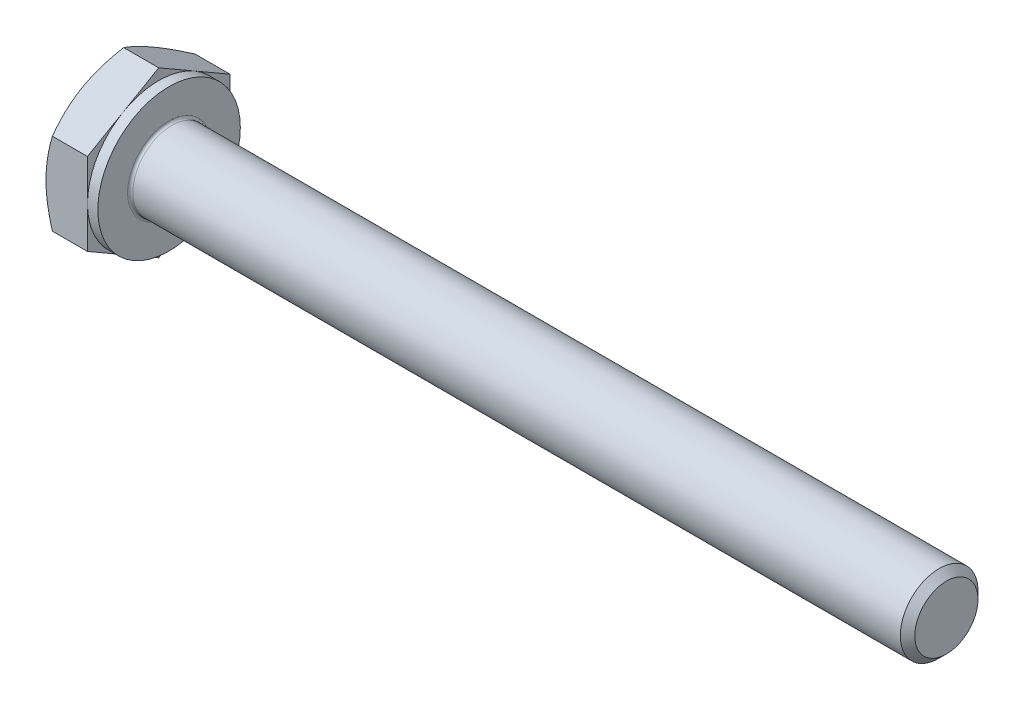
ISO-10303-21;
HEADER;
FILE_DESCRIPTION(('STEP AP214'),'2;1');
FILE_NAME('part.step','',(''),(''),'','','');
FILE_SCHEMA(('AUTOMOTIVE_DESIGN { 1 0 10303 214 1 1 1 1 }'));
ENDSEC;
DATA;
#1=APPLICATION_CONTEXT('core data for automotive mechanical design processes');
#2=APPLICATION_PROTOCOL_DEFINITION('international standard','automotive_design',2000,#1);
#3=PRODUCT_CONTEXT('',#1,'mechanical');
#4=PRODUCT('Part','Part','',(#3));
#5=PRODUCT_RELATED_PRODUCT_CATEGORY('part','',(#4));
#6=PRODUCT_DEFINITION_FORMATION('','',#4);
#7=PRODUCT_DEFINITION_CONTEXT('part definition',#1,'design');
#8=PRODUCT_DEFINITION('design','',#6,#7);
#9=PRODUCT_DEFINITION_SHAPE('','',#8);
#10=(LENGTH_UNIT() NAMED_UNIT(*) SI_UNIT(.MILLI.,.METRE.));
#11=(NAMED_UNIT(*) PLANE_ANGLE_UNIT() SI_UNIT($,.RADIAN.));
#12=(NAMED_UNIT(*) SI_UNIT($,.STERADIAN.) SOLID_ANGLE_UNIT());
#13=UNCERTAINTY_MEASURE_WITH_UNIT(LENGTH_MEASURE(1.E-05),#10,'distance_accuracy_value','');
#14=(GEOMETRIC_REPRESENTATION_CONTEXT(3) GLOBAL_UNCERTAINTY_ASSIGNED_CONTEXT((#13)) GLOBAL_UNIT_ASSIGNED_CONTEXT((#10,
#11,#12)) REPRESENTATION_CONTEXT('',''));
#15=CARTESIAN_POINT('',(0.,0.,0.));
#16=DIRECTION('',(0.,0.,1.));
#17=DIRECTION('',(1.,0.,0.));
#18=AXIS2_PLACEMENT_3D('',#15,#16,#17);
#19=CARTESIAN_POINT('',(2.,3.17542648054294,0.));
#20=DIRECTION('',(1.,0.,0.));
#21=DIRECTION('',(0.,0.,-1.));
#22=AXIS2_PLACEMENT_3D('',#19,#20,#21);
#23=PLANE('',#22);
#24=CARTESIAN_POINT('',(2.,0.,0.));
#25=DIRECTION('',(1.,0.,0.));
#26=DIRECTION('',(0.,0.,-1.));
#27=AXIS2_PLACEMENT_3D('',#24,#25,#26);
#28=CIRCLE('',#27,1.6);
#29=CARTESIAN_POINT('',(2.,0.,-1.6));
#30=VERTEX_POINT('',#29);
#31=EDGE_CURVE('E47',#30,#30,#28,.F.);
#32=ORIENTED_EDGE('',*,*,#31,.T.);
#33=EDGE_LOOP('',(#32));
#34=FACE_BOUND('',#33,.T.);
#35=CARTESIAN_POINT('',(2.,0.,0.));
#36=DIRECTION('',(1.,0.,0.));
#37=DIRECTION('',(0.,0.,-1.));
#38=AXIS2_PLACEMENT_3D('',#35,#36,#37);
#39=CIRCLE('',#38,2.75);
#40=CARTESIAN_POINT('',(2.,0.,-2.75));
#41=VERTEX_POINT('',#40);
#42=EDGE_CURVE('E304',#41,#41,#39,.T.);
#43=ORIENTED_EDGE('',*,*,#42,.T.);
#44=EDGE_LOOP('',(#43));
#45=FACE_BOUND('',#44,.T.);
#46=ADVANCED_FACE('F39',(#34,#45),#23,.T.);
#47=CARTESIAN_POINT('',(0.,0.,0.));
#48=DIRECTION('',(-1.,0.,0.));
#49=DIRECTION('',(0.,0.,1.));
#50=AXIS2_PLACEMENT_3D('',#47,#48,#49);
#51=CYLINDRICAL_SURFACE('',#50,1.5);
#52=CARTESIAN_POINT('',(2.1,0.,0.));
#53=DIRECTION('',(1.,0.,0.));
#54=DIRECTION('',(0.,0.,-1.));
#55=AXIS2_PLACEMENT_3D('',#52,#53,#54);
#56=CIRCLE('',#55,1.5);
#57=CARTESIAN_POINT('',(2.1,0.,-1.5));
#58=VERTEX_POINT('',#57);
#59=EDGE_CURVE('E11',#58,#58,#56,.T.);
#60=ORIENTED_EDGE('',*,*,#59,.T.);
#61=EDGE_LOOP('',(#60));
#62=FACE_BOUND('',#61,.T.);
#63=CARTESIAN_POINT('',(31.7195,0.,0.));
#64=DIRECTION('',(-1.,0.,0.));
#65=DIRECTION('',(0.,0.,1.));
#66=AXIS2_PLACEMENT_3D('',#63,#64,#65);
#67=CIRCLE('',#66,1.5);
#68=CARTESIAN_POINT('',(31.7195,0.,1.5));
#69=VERTEX_POINT('',#68);
#70=EDGE_CURVE('E283',#69,#69,#67,.T.);
#71=ORIENTED_EDGE('',*,*,#70,.T.);
#72=EDGE_LOOP('',(#71));
#73=FACE_BOUND('',#72,.T.);
#74=ADVANCED_FACE('F257',(#62,#73),#51,.T.);
#75=CARTESIAN_POINT('',(32.,0.,0.));
#76=DIRECTION('',(-1.,0.,0.));
#77=DIRECTION('',(0.,0.,1.));
#78=AXIS2_PLACEMENT_3D('',#75,#76,#77);
#79=CONICAL_SURFACE('',#78,1.2195,0.785398163397442);
#80=ORIENTED_EDGE('',*,*,#70,.F.);
#81=EDGE_LOOP('',(#80));
#82=FACE_BOUND('',#81,.T.);
#83=CARTESIAN_POINT('',(32.,0.,0.));
#84=DIRECTION('',(-1.,0.,0.));
#85=DIRECTION('',(0.,0.,1.));
#86=AXIS2_PLACEMENT_3D('',#83,#84,#85);
#87=CIRCLE('',#86,1.2195);
#88=CARTESIAN_POINT('',(32.,0.,1.2195));
#89=VERTEX_POINT('',#88);
#90=EDGE_CURVE('E281',#89,#89,#87,.T.);
#91=ORIENTED_EDGE('',*,*,#90,.T.);
#92=EDGE_LOOP('',(#91));
#93=FACE_BOUND('',#92,.T.);
#94=ADVANCED_FACE('F262',(#82,#93),#79,.T.);
#95=CARTESIAN_POINT('',(32.,0.,0.));
#96=DIRECTION('',(-1.,0.,0.));
#97=DIRECTION('',(0.,0.,1.));
#98=AXIS2_PLACEMENT_3D('',#95,#96,#97);
#99=PLANE('',#98);
#100=ORIENTED_EDGE('',*,*,#90,.F.);
#101=EDGE_LOOP('',(#100));
#102=FACE_BOUND('',#101,.T.);
#103=ADVANCED_FACE('F269',(#102),#99,.F.);
#104=CARTESIAN_POINT('',(1.6,2.75,0.));
#105=DIRECTION('',(1.,0.,0.));
#106=DIRECTION('',(0.,0.,-1.));
#107=AXIS2_PLACEMENT_3D('',#104,#105,#106);
#108=PLANE('',#107);
#109=DIRECTION('',(0.,0.500000000000001,0.866025403784438));
#110=VECTOR('',#109,1.);
#111=CARTESIAN_POINT('',(1.6,1.58771324027147,-2.75));
#112=LINE('',#111,#110);
#113=CARTESIAN_POINT('',(1.6,1.58771324027147,-2.75));
#114=VERTEX_POINT('',#113);
#115=CARTESIAN_POINT('',(1.6,2.3815698604072,-1.375));
#116=VERTEX_POINT('',#115);
#117=EDGE_CURVE('E171',#114,#116,#112,.T.);
#118=ORIENTED_EDGE('',*,*,#117,.T.);
#119=CARTESIAN_POINT('',(1.6,0.,0.));
#120=DIRECTION('',(-1.,0.,0.));
#121=DIRECTION('',(0.,0.,1.));
#122=AXIS2_PLACEMENT_3D('',#119,#120,#121);
#123=CIRCLE('',#122,2.75);
#124=CARTESIAN_POINT('',(1.6,0.,-2.75));
#125=VERTEX_POINT('',#124);
#126=EDGE_CURVE('E54',#116,#125,#123,.T.);
#127=ORIENTED_EDGE('',*,*,#126,.T.);
#128=DIRECTION('',(0.,1.,0.));
#129=VECTOR('',#128,1.);
#130=CARTESIAN_POINT('',(1.6,1.58771324027147,-2.75));
#131=LINE('',#130,#129);
#132=EDGE_CURVE('E307',#125,#114,#131,.T.);
#133=ORIENTED_EDGE('',*,*,#132,.T.);
#134=EDGE_LOOP('',(#118,#127,#133));
#135=FACE_BOUND('',#134,.T.);
#136=ADVANCED_FACE('F272',(#135),#108,.T.);
#137=CARTESIAN_POINT('',(1.6,3.17542648054294,0.));
#138=VERTEX_POINT('',#137);
#139=EDGE_CURVE('E169',#116,#138,#112,.T.);
#140=ORIENTED_EDGE('',*,*,#139,.T.);
#141=DIRECTION('',(0.,-0.500000000000001,0.866025403784438));
#142=VECTOR('',#141,1.);
#143=CARTESIAN_POINT('',(1.6,3.17542648054294,0.));
#144=LINE('',#143,#142);
#145=CARTESIAN_POINT('',(1.6,2.3815698604072,1.375));
#146=VERTEX_POINT('',#145);
#147=EDGE_CURVE('E168',#138,#146,#144,.T.);
#148=ORIENTED_EDGE('',*,*,#147,.T.);
#149=EDGE_CURVE('E157',#146,#116,#123,.T.);
#150=ORIENTED_EDGE('',*,*,#149,.T.);
#151=EDGE_LOOP('',(#140,#148,#150));
#152=FACE_BOUND('',#151,.T.);
#153=ADVANCED_FACE('F277',(#152),#108,.T.);
#154=CARTESIAN_POINT('',(1.6,1.58771324027147,2.75));
#155=VERTEX_POINT('',#154);
#156=EDGE_CURVE('E136',#146,#155,#144,.T.);
#157=ORIENTED_EDGE('',*,*,#156,.T.);
#158=DIRECTION('',(0.,-1.,0.));
#159=VECTOR('',#158,1.);
#160=CARTESIAN_POINT('',(1.6,1.58771324027147,2.75));
#161=LINE('',#160,#159);
#162=CARTESIAN_POINT('',(1.6,0.,2.75));
#163=VERTEX_POINT('',#162);
#164=EDGE_CURVE('E130',#155,#163,#161,.T.);
#165=ORIENTED_EDGE('',*,*,#164,.T.);
#166=EDGE_CURVE('E134',#163,#146,#123,.T.);
#167=ORIENTED_EDGE('',*,*,#166,.T.);
#168=EDGE_LOOP('',(#157,#165,#167));
#169=FACE_BOUND('',#168,.T.);
#170=ADVANCED_FACE('F132',(#169),#108,.T.);
#171=CARTESIAN_POINT('',(1.6,-1.58771324027146,2.75));
#172=VERTEX_POINT('',#171);
#173=EDGE_CURVE('E140',#163,#172,#161,.T.);
#174=ORIENTED_EDGE('',*,*,#173,.T.);
#175=DIRECTION('',(0.,-0.500000000000002,-0.866025403784438));
#176=VECTOR('',#175,1.);
#177=CARTESIAN_POINT('',(1.6,-3.17542648054294,0.));
#178=LINE('',#177,#176);
#179=CARTESIAN_POINT('',(1.6,-2.3815698604072,1.375));
#180=VERTEX_POINT('',#179);
#181=EDGE_CURVE('E147',#172,#180,#178,.T.);
#182=ORIENTED_EDGE('',*,*,#181,.T.);
#183=EDGE_CURVE('E144',#180,#163,#123,.T.);
#184=ORIENTED_EDGE('',*,*,#183,.T.);
#185=EDGE_LOOP('',(#174,#182,#184));
#186=FACE_BOUND('',#185,.T.);
#187=ADVANCED_FACE('F145',(#186),#108,.T.);
#188=CARTESIAN_POINT('',(1.6,-3.17542648054294,0.));
#189=VERTEX_POINT('',#188);
#190=EDGE_CURVE('E163',#180,#189,#178,.T.);
#191=ORIENTED_EDGE('',*,*,#190,.T.);
#192=DIRECTION('',(0.,0.5,-0.866025403784439));
#193=VECTOR('',#192,1.);
#194=CARTESIAN_POINT('',(1.6,-1.58771324027147,-2.75));
#195=LINE('',#194,#193);
#196=CARTESIAN_POINT('',(1.6,-2.38156986040721,-1.375));
#197=VERTEX_POINT('',#196);
#198=EDGE_CURVE('E345',#189,#197,#195,.T.);
#199=ORIENTED_EDGE('',*,*,#198,.T.);
#200=EDGE_CURVE('E151',#197,#180,#123,.T.);
#201=ORIENTED_EDGE('',*,*,#200,.T.);
#202=EDGE_LOOP('',(#191,#199,#201));
#203=FACE_BOUND('',#202,.T.);
#204=ADVANCED_FACE('F346',(#203),#108,.T.);
#205=CARTESIAN_POINT('',(1.6,-1.58771324027147,-2.75));
#206=VERTEX_POINT('',#205);
#207=EDGE_CURVE('E158',#197,#206,#195,.T.);
#208=ORIENTED_EDGE('',*,*,#207,.T.);
#209=EDGE_CURVE('E308',#206,#125,#131,.T.);
#210=ORIENTED_EDGE('',*,*,#209,.T.);
#211=EDGE_CURVE('E315',#125,#197,#123,.T.);
#212=ORIENTED_EDGE('',*,*,#211,.T.);
#213=EDGE_LOOP('',(#208,#210,#212));
#214=FACE_BOUND('',#213,.T.);
#215=ADVANCED_FACE('F278',(#214),#108,.T.);
#216=CARTESIAN_POINT('',(0.,0.,0.));
#217=DIRECTION('',(-1.,0.,0.));
#218=DIRECTION('',(0.,0.,1.));
#219=AXIS2_PLACEMENT_3D('',#216,#217,#218);
#220=CYLINDRICAL_SURFACE('',#219,2.75);
#221=ORIENTED_EDGE('',*,*,#126,.F.);
#222=ORIENTED_EDGE('',*,*,#149,.F.);
#223=ORIENTED_EDGE('',*,*,#166,.F.);
#224=ORIENTED_EDGE('',*,*,#183,.F.);
#225=ORIENTED_EDGE('',*,*,#200,.F.);
#226=ORIENTED_EDGE('',*,*,#211,.F.);
#227=EDGE_LOOP('',(#221,#222,#223,#224,#225,#226));
#228=FACE_BOUND('',#227,.T.);
#229=ORIENTED_EDGE('',*,*,#42,.F.);
#230=EDGE_LOOP('',(#229));
#231=FACE_BOUND('',#230,.T.);
#232=ADVANCED_FACE('F154',(#228,#231),#220,.T.);
#233=CARTESIAN_POINT('',(0.,3.17542648054294,0.));
#234=DIRECTION('',(1.,0.,0.));
#235=DIRECTION('',(0.,0.,-1.));
#236=AXIS2_PLACEMENT_3D('',#233,#234,#235);
#237=PLANE('',#236);
#238=CARTESIAN_POINT('',(0.,0.,0.));
#239=DIRECTION('',(1.,0.,0.));
#240=DIRECTION('',(0.,0.,-1.));
#241=AXIS2_PLACEMENT_3D('',#238,#239,#240);
#242=CIRCLE('',#241,2.75);
#243=CARTESIAN_POINT('',(0.,0.,-2.75));
#244=VERTEX_POINT('',#243);
#245=CARTESIAN_POINT('',(0.,2.3815698604072,-1.375));
#246=VERTEX_POINT('',#245);
#247=EDGE_CURVE('E303',#244,#246,#242,.T.);
#248=ORIENTED_EDGE('',*,*,#247,.F.);
#249=CARTESIAN_POINT('',(0.,-2.38156986040721,-1.375));
#250=VERTEX_POINT('',#249);
#251=EDGE_CURVE('E299',#250,#244,#242,.T.);
#252=ORIENTED_EDGE('',*,*,#251,.F.);
#253=CARTESIAN_POINT('',(0.,-2.3815698604072,1.375));
#254=VERTEX_POINT('',#253);
#255=EDGE_CURVE('E302',#254,#250,#242,.T.);
#256=ORIENTED_EDGE('',*,*,#255,.F.);
#257=CARTESIAN_POINT('',(0.,0.,2.75));
#258=VERTEX_POINT('',#257);
#259=EDGE_CURVE('E338',#258,#254,#242,.T.);
#260=ORIENTED_EDGE('',*,*,#259,.F.);
#261=CARTESIAN_POINT('',(0.,0.,0.));
#262=DIRECTION('',(-1.,0.,0.));
#263=DIRECTION('',(0.,0.,1.));
#264=AXIS2_PLACEMENT_3D('',#261,#262,#263);
#265=CIRCLE('',#264,2.75);
#266=CARTESIAN_POINT('',(0.,2.3815698604072,1.375));
#267=VERTEX_POINT('',#266);
#268=EDGE_CURVE('E172',#258,#267,#265,.T.);
#269=ORIENTED_EDGE('',*,*,#268,.T.);
#270=EDGE_CURVE('E361',#246,#267,#242,.T.);
#271=ORIENTED_EDGE('',*,*,#270,.F.);
#272=EDGE_LOOP('',(#248,#252,#256,#260,#269,#271));
#273=FACE_BOUND('',#272,.T.);
#274=ADVANCED_FACE('F203',(#273),#237,.F.);
#275=CARTESIAN_POINT('',(0.,0.,0.));
#276=DIRECTION('',(1.,0.,0.));
#277=DIRECTION('',(0.,0.,-1.));
#278=AXIS2_PLACEMENT_3D('',#275,#276,#277);
#279=CONICAL_SURFACE('',#278,2.75,1.0471975511966);
#280=CARTESIAN_POINT('',(0.245686763364758,1.58759777021763,2.7502));
#281=CARTESIAN_POINT('',(0.205387662249262,1.65737010029698,2.62935077934009));
#282=CARTESIAN_POINT('',(0.168736902597661,1.72774469983533,2.50745839737737));
#283=CARTESIAN_POINT('',(0.1047621829698,1.86971254687003,2.26156287327211));
#284=CARTESIAN_POINT('',(0.0774608556744964,1.94130831721583,2.13755536142615));
#285=CARTESIAN_POINT('',(0.0349617452941161,2.08361254889599,1.89107720202406));
#286=CARTESIAN_POINT('',(0.0194811186224572,2.15429911309864,1.76864448141258));
#287=CARTESIAN_POINT('',(0.000999397369939996,2.29600490065923,1.52320285763109));
#288=CARTESIAN_POINT('',(-0.00201700053740071,2.36702360884404,1.40019484676709));
#289=CARTESIAN_POINT('',(0.00425314542854635,2.49972966594897,1.17034121338921));
#290=CARTESIAN_POINT('',(0.0120001542767021,2.56143686540073,1.06346120874598));
#291=CARTESIAN_POINT('',(0.0365551810643546,2.68444923614047,0.850397532665251));
#292=CARTESIAN_POINT('',(0.0533715896505702,2.74575398185008,0.744214598351111));
#293=CARTESIAN_POINT('',(0.0954119223459561,2.86902004703206,0.530711510606817));
#294=CARTESIAN_POINT('',(0.12081408068723,2.93096576264318,0.423418383857145));
#295=CARTESIAN_POINT('',(0.178467225839982,3.05393320806134,0.210432520715949));
#296=CARTESIAN_POINT('',(0.210704663298982,3.11495651365995,0.104737054973347));
#297=CARTESIAN_POINT('',(0.24568676336476,3.17554195059678,-0.000199999999999941));
#298=B_SPLINE_CURVE_WITH_KNOTS('',3,(#280,#281,#282,#283,#284,#285,#286,#287,#288,#289,#290,
#291,#292,#293,#294,#295,#296,#297),.UNSPECIFIED.,.F.,.F.,(4,2,2,2,2,2,2,2,4),(0.,
0.435912828725888,0.872873557116332,1.29901931904671,1.72464171213573,2.09526089052938,
2.46622354066374,2.84541551798557,3.22386274754525),.UNSPECIFIED.);
#299=CARTESIAN_POINT('',(0.245620093061862,3.17542648054294,0.));
#300=VERTEX_POINT('',#299);
#301=EDGE_CURVE('E223',#267,#300,#298,.T.);
#302=ORIENTED_EDGE('',*,*,#301,.T.);
#303=CARTESIAN_POINT('',(0.24568676336476,3.17554195059678,0.0002));
#304=CARTESIAN_POINT('',(0.205387662249263,3.10576962051743,-0.120649220659906));
#305=CARTESIAN_POINT('',(0.168736902597662,3.03539502097908,-0.242541602622634));
#306=CARTESIAN_POINT('',(0.104762182969801,2.89342717394439,-0.488437126727892));
#307=CARTESIAN_POINT('',(0.0774608556744972,2.82183140359858,-0.612444638573855));
#308=CARTESIAN_POINT('',(0.0349617452941164,2.67952717191842,-0.858922797975944));
#309=CARTESIAN_POINT('',(0.0194811186224572,2.60884060771577,-0.981355518587417));
#310=CARTESIAN_POINT('',(0.000999397369939725,2.46713482015518,-1.22679714236891));
#311=CARTESIAN_POINT('',(-0.00201700053740102,2.39611611197038,-1.34980515323291));
#312=CARTESIAN_POINT('',(0.0042531454285458,2.26341005486544,-1.57965878661079));
#313=CARTESIAN_POINT('',(0.0120001542767013,2.20170285541368,-1.68653879125402));
#314=CARTESIAN_POINT('',(0.0365551810643535,2.07869048467394,-1.89960246733475));
#315=CARTESIAN_POINT('',(0.0533715896505689,2.01738573896433,-2.00578540164889));
#316=CARTESIAN_POINT('',(0.0954119223459547,1.89411967378235,-2.21928848939318));
#317=CARTESIAN_POINT('',(0.120814080687229,1.83217395817123,-2.32658161614285));
#318=CARTESIAN_POINT('',(0.17846722583998,1.70920651275307,-2.53956747928405));
#319=CARTESIAN_POINT('',(0.21070466329898,1.64818320715446,-2.64526294502665));
#320=CARTESIAN_POINT('',(0.245686763364758,1.58759777021763,-2.7502));
#321=B_SPLINE_CURVE_WITH_KNOTS('',3,(#303,#304,#305,#306,#307,#308,#309,#310,#311,#312,#313,
#314,#315,#316,#317,#318,#319,#320),.UNSPECIFIED.,.F.,.F.,(4,2,2,2,2,2,2,2,4),(0.,
0.435912828725888,0.872873557116332,1.29901931904672,1.72464171213574,2.09526089052938,
2.46622354066374,2.84541551798557,3.22386274754524),.UNSPECIFIED.);
#322=EDGE_CURVE('E62',#300,#246,#321,.T.);
#323=ORIENTED_EDGE('',*,*,#322,.T.);
#324=ORIENTED_EDGE('',*,*,#270,.T.);
#325=EDGE_LOOP('',(#302,#323,#324));
#326=FACE_BOUND('',#325,.T.);
#327=ADVANCED_FACE('F362',(#326),#279,.T.);
#328=CARTESIAN_POINT('',(1.36715210704407,-4.31638594918233,2.75));
#329=CARTESIAN_POINT('',(1.30845994096475,-4.19581737051594,2.75));
#330=CARTESIAN_POINT('',(1.25031586425217,-4.07497746694741,2.75));
#331=CARTESIAN_POINT('',(1.1354311974123,-3.83261088383625,2.75));
#332=CARTESIAN_POINT('',(1.07869081888198,-3.71108410410336,2.75));
#333=CARTESIAN_POINT('',(0.966646426591334,-3.46659808789898,2.75));
#334=CARTESIAN_POINT('',(0.911351476138769,-3.34363468385965,2.75));
#335=CARTESIAN_POINT('',(0.802956993957645,-3.09674757673778,2.75));
#336=CARTESIAN_POINT('',(0.749857361778772,-2.97282391790201,2.75));
#337=CARTESIAN_POINT('',(0.644703117588252,-2.71965806564944,2.75));
#338=CARTESIAN_POINT('',(0.59274272436712,-2.59037652858396,2.75));
#339=CARTESIAN_POINT('',(0.492631038352348,-2.33032018429189,2.75));
#340=CARTESIAN_POINT('',(0.444480165603222,-2.19954521421088,2.75));
#341=CARTESIAN_POINT('',(0.353213656190185,-1.9365223444922,2.75));
#342=CARTESIAN_POINT('',(0.310088265151206,-1.80427786301002,2.75));
#343=CARTESIAN_POINT('',(0.230222209632179,-1.53789259482414,2.75));
#344=CARTESIAN_POINT('',(0.193479588678774,-1.40375240288282,2.75));
#345=CARTESIAN_POINT('',(0.12830206779166,-1.13423793476321,2.75));
#346=CARTESIAN_POINT('',(0.0998212369444743,-0.998874970875645,2.75));
#347=CARTESIAN_POINT('',(0.0527456161691624,-0.726413092453876,2.75));
#348=CARTESIAN_POINT('',(0.0341497721022244,-0.589314364619266,2.75));
#349=CARTESIAN_POINT('',(0.00856858652497934,-0.315877662564295,2.75));
#350=CARTESIAN_POINT('',(0.00142992679050954,-0.179554395289442,2.75));
#351=CARTESIAN_POINT('',(-0.0010386746355905,0.0932131339370738,2.75));
#352=CARTESIAN_POINT('',(0.00363158744684201,0.229657397936034,2.75));
#353=CARTESIAN_POINT('',(0.0211304631968839,0.459764674388295,2.75));
#354=CARTESIAN_POINT('',(0.0310050171194686,0.553667213671706,2.75));
#355=CARTESIAN_POINT('',(0.0557601395316544,0.740814471055651,2.75));
#356=CARTESIAN_POINT('',(0.0706413439292719,0.834059104057001,2.75));
#357=CARTESIAN_POINT('',(0.122015798898187,1.1126628310975,2.75));
#358=CARTESIAN_POINT('',(0.165231761163531,1.29679769159136,2.75));
#359=CARTESIAN_POINT('',(0.240559912331172,1.57226006867406,2.75));
#360=CARTESIAN_POINT('',(0.267790894506834,1.66500394654354,2.75));
#361=CARTESIAN_POINT('',(0.325176661417268,1.84959145582333,2.75));
#362=CARTESIAN_POINT('',(0.35533146826406,1.94143508041952,2.75));
#363=CARTESIAN_POINT('',(0.418073021824298,2.12425036464147,2.75));
#364=CARTESIAN_POINT('',(0.450659060772915,2.21522226940175,2.75));
#365=CARTESIAN_POINT('',(0.517870145035889,2.39640501304851,2.75));
#366=CARTESIAN_POINT('',(0.552495146383987,2.48661586829763,2.75));
#367=CARTESIAN_POINT('',(0.647111868128755,2.72631941369535,2.75));
#368=CARTESIAN_POINT('',(0.708617133437116,2.87521406734215,2.75));
#369=CARTESIAN_POINT('',(0.835163108096427,3.17149877963135,2.75));
#370=CARTESIAN_POINT('',(0.900204187184539,3.31888867900128,2.75));
#371=CARTESIAN_POINT('',(1.03299372984212,3.61249860697601,2.75));
#372=CARTESIAN_POINT('',(1.1007430819779,3.75871823242041,2.75));
#373=CARTESIAN_POINT('',(1.23832197569377,4.05017738563285,2.75));
#374=CARTESIAN_POINT('',(1.30815157882391,4.19541688424482,2.75));
#375=CARTESIAN_POINT('',(1.52027220806309,4.6303907022318,2.75));
#376=CARTESIAN_POINT('',(1.66499194206912,4.91893915080496,2.75));
#377=CARTESIAN_POINT('',(1.95851426505824,5.49386340867003,2.75));
#378=CARTESIAN_POINT('',(2.10731603787552,5.78023963786973,2.75));
#379=CARTESIAN_POINT('',(2.39216757225534,6.32194576487133,2.75));
#380=CARTESIAN_POINT('',(2.52794261914922,6.57742037004849,2.75));
#381=CARTESIAN_POINT('',(2.80114245272761,7.08750371442346,2.75));
#382=CARTESIAN_POINT('',(2.93856733551164,7.34211240206399,2.75));
#383=CARTESIAN_POINT('',(3.21419429818604,7.84983547824255,2.75));
#384=CARTESIAN_POINT('',(3.35239239225701,8.10295203313653,2.75));
#385=CARTESIAN_POINT('',(3.62973059253267,8.60864374493555,2.75));
#386=CARTESIAN_POINT('',(3.76887062638959,8.86121894150218,2.75));
#387=CARTESIAN_POINT('',(3.90835389259639,9.11360311770114,2.75));
#388=B_SPLINE_CURVE_WITH_KNOTS('',3,(#328,#329,#330,#331,#332,#333,#334,#335,#336,#337,#338,
#339,#340,#341,#342,#343,#344,#345,#346,#347,#348,#349,#350,#351,#352,#353,#354,#355,#356,#357,
#358,#359,#360,#361,#362,#363,#364,#365,#366,#367,#368,#369,#370,#371,#372,#373,#374,#375,#376,
#377,#378,#379,#380,#381,#382,#383,#384,#385,#386,#387),.UNSPECIFIED.,.F.,.F.,(4,2,2,2,2,2,2,2,
2,2,2,2,2,2,2,2,2,2,2,2,2,2,2,2,2,2,2,2,2,4),(0.,0.402290608258891,0.804641493784546,
1.20909649725656,1.61353297371179,2.03148461048146,2.44948226730265,2.86665458560836,
3.28369880400759,3.69837799217317,4.11301294991383,4.52205162226936,4.9310973530204,
5.21422195546486,5.49738253190366,6.06398562819834,6.35393648052212,6.6438895258295,
6.933758488749,7.2236212034952,7.70684704660549,8.19012351781084,8.67355987154435,
9.15701054332952,10.1253686031769,11.0935344400116,11.9614658313278,12.8294480255313,
13.6946049258819,14.5596961132789),.UNSPECIFIED.);
#389=CARTESIAN_POINT('',(0.24562009306186,1.58771324027147,2.75));
#390=VERTEX_POINT('',#389);
#391=EDGE_CURVE('E237',#258,#390,#388,.T.);
#392=ORIENTED_EDGE('',*,*,#391,.T.);
#393=EDGE_CURVE('E236',#390,#267,#298,.T.);
#394=ORIENTED_EDGE('',*,*,#393,.T.);
#395=ORIENTED_EDGE('',*,*,#268,.F.);
#396=EDGE_LOOP('',(#392,#394,#395));
#397=FACE_BOUND('',#396,.T.);
#398=ADVANCED_FACE('F332',(#397),#279,.T.);
#399=CARTESIAN_POINT('',(0.245620093061859,-1.58771324027146,2.75));
#400=VERTEX_POINT('',#399);
#401=EDGE_CURVE('E284',#400,#258,#388,.T.);
#402=ORIENTED_EDGE('',*,*,#401,.T.);
#403=ORIENTED_EDGE('',*,*,#259,.T.);
#404=CARTESIAN_POINT('',(0.24568676336476,-3.17554195059678,-0.000200000000000053));
#405=CARTESIAN_POINT('',(0.205387662249263,-3.10576962051743,0.120649220659906));
#406=CARTESIAN_POINT('',(0.168736902597662,-3.03539502097908,0.242541602622633));
#407=CARTESIAN_POINT('',(0.104762182969801,-2.89342717394439,0.488437126727892));
#408=CARTESIAN_POINT('',(0.0774608556744971,-2.82183140359858,0.612444638573855));
#409=CARTESIAN_POINT('',(0.0349617452941162,-2.67952717191842,0.858922797975943));
#410=CARTESIAN_POINT('',(0.0194811186224568,-2.60884060771577,0.981355518587416));
#411=CARTESIAN_POINT('',(0.00099939736993911,-2.46713482015518,1.22679714236891));
#412=CARTESIAN_POINT('',(-0.00201700053740174,-2.39611611197037,1.34980515323291));
#413=CARTESIAN_POINT('',(0.00425314542854491,-2.26341005486544,1.57965878661079));
#414=CARTESIAN_POINT('',(0.0120001542767004,-2.20170285541368,1.68653879125402));
#415=CARTESIAN_POINT('',(0.0365551810643526,-2.07869048467394,1.89960246733475));
#416=CARTESIAN_POINT('',(0.053371589650568,-2.01738573896433,2.00578540164889));
#417=CARTESIAN_POINT('',(0.0954119223459539,-1.89411967378234,2.21928848939318));
#418=CARTESIAN_POINT('',(0.120814080687228,-1.83217395817123,2.32658161614285));
#419=CARTESIAN_POINT('',(0.178467225839979,-1.70920651275307,2.53956747928405));
#420=CARTESIAN_POINT('',(0.210704663298979,-1.64818320715446,2.64526294502665));
#421=CARTESIAN_POINT('',(0.245686763364757,-1.58759777021763,2.7502));
#422=B_SPLINE_CURVE_WITH_KNOTS('',3,(#404,#405,#406,#407,#408,#409,#410,#411,#412,#413,#414,
#415,#416,#417,#418,#419,#420,#421),.UNSPECIFIED.,.F.,.F.,(4,2,2,2,2,2,2,2,4),(0.,
0.435912828725889,0.872873557116332,1.29901931904672,1.72464171213574,2.09526089052938,
2.46622354066374,2.84541551798557,3.22386274754525),.UNSPECIFIED.);
#423=EDGE_CURVE('E225',#254,#400,#422,.T.);
#424=ORIENTED_EDGE('',*,*,#423,.T.);
#425=EDGE_LOOP('',(#402,#403,#424));
#426=FACE_BOUND('',#425,.T.);
#427=ADVANCED_FACE('F192',(#426),#279,.T.);
#428=CARTESIAN_POINT('',(0.245620093061862,-3.17542648054294,0.));
#429=VERTEX_POINT('',#428);
#430=EDGE_CURVE('E217',#429,#254,#422,.T.);
#431=ORIENTED_EDGE('',*,*,#430,.T.);
#432=ORIENTED_EDGE('',*,*,#255,.T.);
#433=CARTESIAN_POINT('',(0.24568676336476,-1.58759777021764,-2.7502));
#434=CARTESIAN_POINT('',(0.205387662249263,-1.65737010029699,-2.62935077934009));
#435=CARTESIAN_POINT('',(0.168736902597662,-1.72774469983533,-2.50745839737737));
#436=CARTESIAN_POINT('',(0.104762182969801,-1.86971254687003,-2.26156287327211));
#437=CARTESIAN_POINT('',(0.0774608556744979,-1.94130831721583,-2.13755536142614));
#438=CARTESIAN_POINT('',(0.0349617452941175,-2.08361254889599,-1.89107720202406));
#439=CARTESIAN_POINT('',(0.0194811186224585,-2.15429911309864,-1.76864448141258));
#440=CARTESIAN_POINT('',(0.000999397369941222,-2.29600490065923,-1.52320285763108));
#441=CARTESIAN_POINT('',(-0.00201700053739948,-2.36702360884404,-1.40019484676709));
#442=CARTESIAN_POINT('',(0.00425314542854749,-2.49972966594897,-1.17034121338921));
#443=CARTESIAN_POINT('',(0.0120001542767031,-2.56143686540073,-1.06346120874598));
#444=CARTESIAN_POINT('',(0.0365551810643554,-2.68444923614047,-0.85039753266525));
#445=CARTESIAN_POINT('',(0.0533715896505708,-2.74575398185008,-0.744214598351111));
#446=CARTESIAN_POINT('',(0.0954119223459566,-2.86902004703207,-0.530711510606816));
#447=CARTESIAN_POINT('',(0.120814080687231,-2.93096576264318,-0.423418383857144));
#448=CARTESIAN_POINT('',(0.178467225839982,-3.05393320806134,-0.210432520715948));
#449=CARTESIAN_POINT('',(0.210704663298982,-3.11495651365995,-0.104737054973347));
#450=CARTESIAN_POINT('',(0.24568676336476,-3.17554195059678,0.000200000000000134));
#451=B_SPLINE_CURVE_WITH_KNOTS('',3,(#433,#434,#435,#436,#437,#438,#439,#440,#441,#442,#443,
#444,#445,#446,#447,#448,#449,#450),.UNSPECIFIED.,.F.,.F.,(4,2,2,2,2,2,2,2,4),(0.,
0.435912828725888,0.872873557116332,1.29901931904672,1.72464171213574,2.09526089052938,
2.46622354066374,2.84541551798557,3.22386274754524),.UNSPECIFIED.);
#452=EDGE_CURVE('E224',#250,#429,#451,.T.);
#453=ORIENTED_EDGE('',*,*,#452,.T.);
#454=EDGE_LOOP('',(#431,#432,#453));
#455=FACE_BOUND('',#454,.T.);
#456=ADVANCED_FACE('F360',(#455),#279,.T.);
#457=CARTESIAN_POINT('',(0.24562009306186,1.58771324027147,-2.75));
#458=VERTEX_POINT('',#457);
#459=EDGE_CURVE('E226',#246,#458,#321,.T.);
#460=ORIENTED_EDGE('',*,*,#459,.T.);
#461=CARTESIAN_POINT('',(1.3671521078078,-4.31638595075081,-2.75));
#462=CARTESIAN_POINT('',(1.30845994169662,-4.19581737203162,-2.75));
#463=CARTESIAN_POINT('',(1.25031586495221,-4.07497746841026,-2.75));
#464=CARTESIAN_POINT('',(1.13543119804882,-3.83261088519327,-2.75));
#465=CARTESIAN_POINT('',(1.07869081948681,-3.7110841054074,-2.75));
#466=CARTESIAN_POINT('',(0.966646427132785,-3.46659808909623,-2.75));
#467=CARTESIAN_POINT('',(0.911351476648524,-3.3436346850031,-2.75));
#468=CARTESIAN_POINT('',(0.802956994404532,-3.09674757777326,-2.75));
#469=CARTESIAN_POINT('',(0.749857362194487,-2.97282391888333,-2.75));
#470=CARTESIAN_POINT('',(0.644703117940711,-2.71965806651822,-2.75));
#471=CARTESIAN_POINT('',(0.592742724687567,-2.59037652939431,-2.75));
#472=CARTESIAN_POINT('',(0.492631038610472,-2.33032018498447,-2.75));
#473=CARTESIAN_POINT('',(0.444480165831036,-2.19954521484411,-2.75));
#474=CARTESIAN_POINT('',(0.353213656360264,-1.93652234500563,-2.75));
#475=CARTESIAN_POINT('',(0.310088265293853,-1.80427786346299,-2.75));
#476=CARTESIAN_POINT('',(0.230222209724415,-1.53789259515457,-2.75));
#477=CARTESIAN_POINT('',(0.193479588748028,-1.40375240315116,-2.75));
#478=CARTESIAN_POINT('',(0.128302067814518,-1.13423793487563,-2.75));
#479=CARTESIAN_POINT('',(0.0998212369456785,-0.998874970893802,-2.75));
#480=CARTESIAN_POINT('',(0.0527456161412603,-0.726413092281217,-2.75));
#481=CARTESIAN_POINT('',(0.0341497720668585,-0.589314364350055,-2.75));
#482=CARTESIAN_POINT('',(0.00856858649190677,-0.315877662103571,-2.75));
#483=CARTESIAN_POINT('',(0.00142992676687439,-0.179554394733774,-2.75));
#484=CARTESIAN_POINT('',(-0.0010386746237345,0.0932131346811956,-2.75));
#485=CARTESIAN_POINT('',(0.00363158748475599,0.229657398773667,-2.75));
#486=CARTESIAN_POINT('',(0.0211304632874208,0.45976467534314,-2.75));
#487=CARTESIAN_POINT('',(0.0310050172308485,0.553667214651313,-2.75));
#488=CARTESIAN_POINT('',(0.0557601396858251,0.740814472083668,-2.75));
#489=CARTESIAN_POINT('',(0.0706413441053906,0.834059105108665,-2.75));
#490=CARTESIAN_POINT('',(0.122015799140606,1.1126628322188,-2.75));
#491=CARTESIAN_POINT('',(0.16523176145073,1.29679769275726,-2.75));
#492=CARTESIAN_POINT('',(0.240559912684437,1.57226006990665,-2.75));
#493=CARTESIAN_POINT('',(0.267790894882274,1.66500394779883,-2.75));
#494=CARTESIAN_POINT('',(0.325176661836373,1.84959145712379,-2.75));
#495=CARTESIAN_POINT('',(0.355331468704655,1.94143508174243,-2.75));
#496=CARTESIAN_POINT('',(0.4180730223071,2.12425036600913,-2.75));
#497=CARTESIAN_POINT('',(0.450659061276432,2.21522227079169,-2.75));
#498=CARTESIAN_POINT('',(0.517870145580111,2.39640501448303,-2.75));
#499=CARTESIAN_POINT('',(0.552495146948199,2.48661586975443,-2.75));
#500=CARTESIAN_POINT('',(0.647111868726994,2.72631941516506,-2.75));
#501=CARTESIAN_POINT('',(0.708617134047326,2.87521406880311,-2.75));
#502=CARTESIAN_POINT('',(0.835163108727168,3.17149878107592,-2.75));
#503=CARTESIAN_POINT('',(0.900204187823838,3.31888868043822,-2.75));
#504=CARTESIAN_POINT('',(1.03299373049605,3.61249860839851,-2.75));
#505=CARTESIAN_POINT('',(1.10074308263791,3.7587182338361,-2.75));
#506=CARTESIAN_POINT('',(1.23832197636415,4.05017738703563,-2.75));
#507=CARTESIAN_POINT('',(1.30815157949859,4.19541688564151,-2.75));
#508=CARTESIAN_POINT('',(1.52027220874839,4.63039070361032,-2.75));
#509=CARTESIAN_POINT('',(1.6649919427588,4.91893915217225,-2.75));
#510=CARTESIAN_POINT('',(1.95851426575388,5.49386341001633,-2.75));
#511=CARTESIAN_POINT('',(2.10731603857273,5.78023963920629,-2.75));
#512=CARTESIAN_POINT('',(2.39216757295806,6.32194576619817,-2.75));
#513=CARTESIAN_POINT('',(2.52794261985612,6.57742037137523,-2.75));
#514=CARTESIAN_POINT('',(2.80114245344201,7.08750371575041,-2.75));
#515=CARTESIAN_POINT('',(2.93856733622937,7.34211240339124,-2.75));
#516=CARTESIAN_POINT('',(3.21419429891057,7.84983547957205,-2.75));
#517=CARTESIAN_POINT('',(3.35239239298502,8.10295203446796,-2.75));
#518=CARTESIAN_POINT('',(3.62973059326726,8.6086437462711,-2.75));
#519=CARTESIAN_POINT('',(3.76887062712728,8.86121894283992,-2.75));
#520=CARTESIAN_POINT('',(3.90835389333705,9.11360311904112,-2.75));
#521=B_SPLINE_CURVE_WITH_KNOTS('',3,(#461,#462,#463,#464,#465,#466,#467,#468,#469,#470,#471,
#472,#473,#474,#475,#476,#477,#478,#479,#480,#481,#482,#483,#484,#485,#486,#487,#488,#489,#490,
#491,#492,#493,#494,#495,#496,#497,#498,#499,#500,#501,#502,#503,#504,#505,#506,#507,#508,#509,
#510,#511,#512,#513,#514,#515,#516,#517,#518,#519,#520),.UNSPECIFIED.,.F.,.F.,(4,2,2,2,2,2,2,2,
2,2,2,2,2,2,2,2,2,2,2,2,2,2,2,2,2,2,2,2,2,4),(0.,0.402290608443125,0.804641494153041,
1.20909649781126,1.61353297445268,2.03148461142075,2.44948226844042,2.86665458694395,
3.28369880554084,3.69837799399592,4.11301295202565,4.52205162466304,4.93109735569609,
5.21422195822095,5.49738253474016,6.06398563119599,6.35393648360392,6.64388952899543,
6.93375849199886,7.22362120682899,7.70684704992886,8.19012352112368,8.67355987484636,
9.15701054662066,10.1253686064439,11.0935344432549,11.9614658345767,12.8294480287857,
13.6946049291465,14.5596961165537),.UNSPECIFIED.);
#522=EDGE_CURVE('E184',#458,#244,#521,.F.);
#523=ORIENTED_EDGE('',*,*,#522,.T.);
#524=ORIENTED_EDGE('',*,*,#247,.T.);
#525=EDGE_LOOP('',(#460,#523,#524));
#526=FACE_BOUND('',#525,.T.);
#527=ADVANCED_FACE('F357',(#526),#279,.T.);
#528=CARTESIAN_POINT('',(0.24562009306175,-1.58771324027164,-2.75));
#529=VERTEX_POINT('',#528);
#530=EDGE_CURVE('E185',#529,#250,#451,.T.);
#531=ORIENTED_EDGE('',*,*,#530,.T.);
#532=ORIENTED_EDGE('',*,*,#251,.T.);
#533=EDGE_CURVE('E175',#244,#529,#521,.F.);
#534=ORIENTED_EDGE('',*,*,#533,.T.);
#535=EDGE_LOOP('',(#531,#532,#534));
#536=FACE_BOUND('',#535,.T.);
#537=ADVANCED_FACE('F201',(#536),#279,.T.);
#538=CARTESIAN_POINT('',(2.,1.58771324027147,-2.75));
#539=DIRECTION('',(0.,0.,1.));
#540=DIRECTION('',(0.,-1.,0.));
#541=AXIS2_PLACEMENT_3D('',#538,#539,#540);
#542=PLANE('',#541);
#543=ORIENTED_EDGE('',*,*,#209,.F.);
#544=DIRECTION('',(-1.,0.,0.));
#545=VECTOR('',#544,1.);
#546=CARTESIAN_POINT('',(2.,-1.58771324027147,-2.75));
#547=LINE('',#546,#545);
#548=EDGE_CURVE('E290',#206,#529,#547,.T.);
#549=ORIENTED_EDGE('',*,*,#548,.T.);
#550=ORIENTED_EDGE('',*,*,#533,.F.);
#551=ORIENTED_EDGE('',*,*,#522,.F.);
#552=DIRECTION('',(-1.,0.,0.));
#553=VECTOR('',#552,1.);
#554=CARTESIAN_POINT('',(2.,1.58771324027147,-2.75));
#555=LINE('',#554,#553);
#556=EDGE_CURVE('E286',#114,#458,#555,.T.);
#557=ORIENTED_EDGE('',*,*,#556,.F.);
#558=ORIENTED_EDGE('',*,*,#132,.F.);
#559=EDGE_LOOP('',(#543,#549,#550,#551,#557,#558));
#560=FACE_BOUND('',#559,.T.);
#561=ADVANCED_FACE('F196',(#560),#542,.F.);
#562=CARTESIAN_POINT('',(2.,-1.58771324027147,-2.75));
#563=DIRECTION('',(0.,0.866025403784439,0.5));
#564=DIRECTION('',(0.,-0.5,0.866025403784439));
#565=AXIS2_PLACEMENT_3D('',#562,#563,#564);
#566=PLANE('',#565);
#567=ORIENTED_EDGE('',*,*,#198,.F.);
#568=DIRECTION('',(-1.,0.,0.));
#569=VECTOR('',#568,1.);
#570=CARTESIAN_POINT('',(2.,-3.17542648054294,0.));
#571=LINE('',#570,#569);
#572=EDGE_CURVE('E292',#189,#429,#571,.T.);
#573=ORIENTED_EDGE('',*,*,#572,.T.);
#574=ORIENTED_EDGE('',*,*,#452,.F.);
#575=ORIENTED_EDGE('',*,*,#530,.F.);
#576=ORIENTED_EDGE('',*,*,#548,.F.);
#577=ORIENTED_EDGE('',*,*,#207,.F.);
#578=EDGE_LOOP('',(#567,#573,#574,#575,#576,#577));
#579=FACE_BOUND('',#578,.T.);
#580=ADVANCED_FACE('F200',(#579),#566,.F.);
#581=CARTESIAN_POINT('',(2.,-3.17542648054294,0.));
#582=DIRECTION('',(0.,0.866025403784438,-0.500000000000002));
#583=DIRECTION('',(0.,0.500000000000002,0.866025403784438));
#584=AXIS2_PLACEMENT_3D('',#581,#582,#583);
#585=PLANE('',#584);
#586=ORIENTED_EDGE('',*,*,#181,.F.);
#587=DIRECTION('',(-1.,0.,0.));
#588=VECTOR('',#587,1.);
#589=CARTESIAN_POINT('',(2.,-1.58771324027146,2.75));
#590=LINE('',#589,#588);
#591=EDGE_CURVE('E162',#172,#400,#590,.T.);
#592=ORIENTED_EDGE('',*,*,#591,.T.);
#593=ORIENTED_EDGE('',*,*,#423,.F.);
#594=ORIENTED_EDGE('',*,*,#430,.F.);
#595=ORIENTED_EDGE('',*,*,#572,.F.);
#596=ORIENTED_EDGE('',*,*,#190,.F.);
#597=EDGE_LOOP('',(#586,#592,#593,#594,#595,#596));
#598=FACE_BOUND('',#597,.T.);
#599=ADVANCED_FACE('F208',(#598),#585,.F.);
#600=CARTESIAN_POINT('',(2.,1.58771324027147,2.75));
#601=DIRECTION('',(0.,0.,-1.));
#602=DIRECTION('',(-1.,0.,0.));
#603=AXIS2_PLACEMENT_3D('',#600,#601,#602);
#604=PLANE('',#603);
#605=ORIENTED_EDGE('',*,*,#164,.F.);
#606=DIRECTION('',(-1.,0.,0.));
#607=VECTOR('',#606,1.);
#608=CARTESIAN_POINT('',(2.,1.58771324027147,2.75));
#609=LINE('',#608,#607);
#610=EDGE_CURVE('E295',#155,#390,#609,.T.);
#611=ORIENTED_EDGE('',*,*,#610,.T.);
#612=ORIENTED_EDGE('',*,*,#391,.F.);
#613=ORIENTED_EDGE('',*,*,#401,.F.);
#614=ORIENTED_EDGE('',*,*,#591,.F.);
#615=ORIENTED_EDGE('',*,*,#173,.F.);
#616=EDGE_LOOP('',(#605,#611,#612,#613,#614,#615));
#617=FACE_BOUND('',#616,.T.);
#618=ADVANCED_FACE('F160',(#617),#604,.F.);
#619=CARTESIAN_POINT('',(2.,3.17542648054294,0.));
#620=DIRECTION('',(0.,-0.866025403784438,-0.500000000000001));
#621=DIRECTION('',(0.,0.500000000000001,-0.866025403784438));
#622=AXIS2_PLACEMENT_3D('',#619,#620,#621);
#623=PLANE('',#622);
#624=ORIENTED_EDGE('',*,*,#147,.F.);
#625=DIRECTION('',(-1.,0.,0.));
#626=VECTOR('',#625,1.);
#627=CARTESIAN_POINT('',(2.,3.17542648054294,0.));
#628=LINE('',#627,#626);
#629=EDGE_CURVE('E297',#138,#300,#628,.T.);
#630=ORIENTED_EDGE('',*,*,#629,.T.);
#631=ORIENTED_EDGE('',*,*,#301,.F.);
#632=ORIENTED_EDGE('',*,*,#393,.F.);
#633=ORIENTED_EDGE('',*,*,#610,.F.);
#634=ORIENTED_EDGE('',*,*,#156,.F.);
#635=EDGE_LOOP('',(#624,#630,#631,#632,#633,#634));
#636=FACE_BOUND('',#635,.T.);
#637=ADVANCED_FACE('F243',(#636),#623,.F.);
#638=CARTESIAN_POINT('',(2.,1.58771324027147,-2.75));
#639=DIRECTION('',(0.,-0.866025403784438,0.500000000000001));
#640=DIRECTION('',(0.,-0.500000000000001,-0.866025403784438));
#641=AXIS2_PLACEMENT_3D('',#638,#639,#640);
#642=PLANE('',#641);
#643=ORIENTED_EDGE('',*,*,#117,.F.);
#644=ORIENTED_EDGE('',*,*,#556,.T.);
#645=ORIENTED_EDGE('',*,*,#459,.F.);
#646=ORIENTED_EDGE('',*,*,#322,.F.);
#647=ORIENTED_EDGE('',*,*,#629,.F.);
#648=ORIENTED_EDGE('',*,*,#139,.F.);
#649=EDGE_LOOP('',(#643,#644,#645,#646,#647,#648));
#650=FACE_BOUND('',#649,.T.);
#651=ADVANCED_FACE('F246',(#650),#642,.F.);
#652=CARTESIAN_POINT('',(2.1,0.,0.));
#653=DIRECTION('',(1.,0.,0.));
#654=DIRECTION('',(0.,0.,-1.));
#655=AXIS2_PLACEMENT_3D('',#652,#653,#654);
#656=TOROIDAL_SURFACE('',#655,1.6,0.1);
#657=ORIENTED_EDGE('',*,*,#59,.F.);
#658=EDGE_LOOP('',(#657));
#659=FACE_BOUND('',#658,.T.);
#660=ORIENTED_EDGE('',*,*,#31,.F.);
#661=EDGE_LOOP('',(#660));
#662=FACE_BOUND('',#661,.T.);
#663=ADVANCED_FACE('F41',(#659,#662),#656,.F.);
#664=CLOSED_SHELL('',(#46,#74,#94,#103,#136,#153,#170,#187,#204,#215,#232,#274,#327,#398,#427,
#456,#527,#537,#561,#580,#599,#618,#637,#651,#663));
#665=MANIFOLD_SOLID_BREP('B2',#664);
#666=ADVANCED_BREP_SHAPE_REPRESENTATION('',(#18,#665),#14);
#667=SHAPE_DEFINITION_REPRESENTATION(#9,#666);
ENDSEC;
END-ISO-10303-21;
